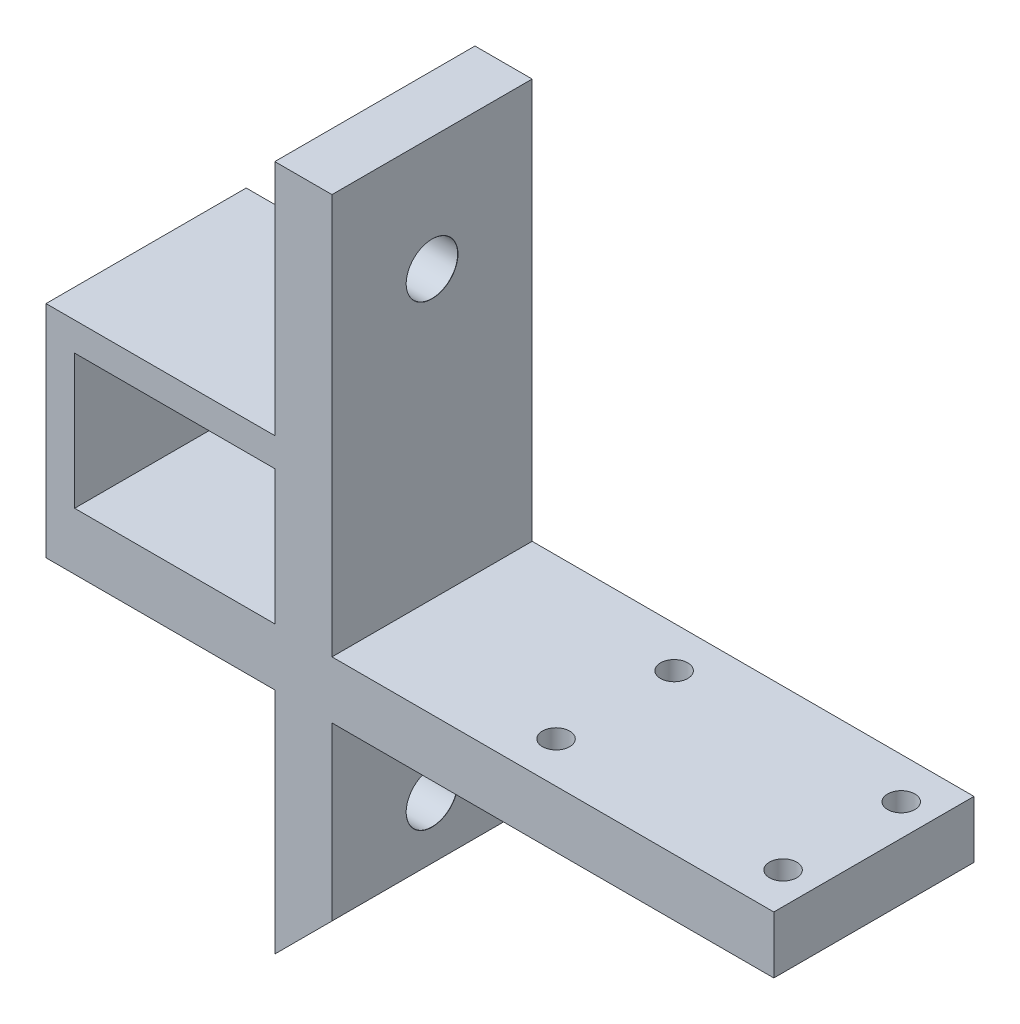
ISO-10303-21;
HEADER;
FILE_DESCRIPTION(('STEP AP214'),'2;1');
FILE_NAME('part.step','',(''),(''),'','','');
FILE_SCHEMA(('AUTOMOTIVE_DESIGN { 1 0 10303 214 1 1 1 1 }'));
ENDSEC;
DATA;
#1=APPLICATION_CONTEXT('core data for automotive mechanical design processes');
#2=APPLICATION_PROTOCOL_DEFINITION('international standard','automotive_design',2000,#1);
#3=PRODUCT_CONTEXT('',#1,'mechanical');
#4=PRODUCT('Part','Part','',(#3));
#5=PRODUCT_RELATED_PRODUCT_CATEGORY('part','',(#4));
#6=PRODUCT_DEFINITION_FORMATION('','',#4);
#7=PRODUCT_DEFINITION_CONTEXT('part definition',#1,'design');
#8=PRODUCT_DEFINITION('design','',#6,#7);
#9=PRODUCT_DEFINITION_SHAPE('','',#8);
#10=(LENGTH_UNIT() NAMED_UNIT(*) SI_UNIT(.MILLI.,.METRE.));
#11=(NAMED_UNIT(*) PLANE_ANGLE_UNIT() SI_UNIT($,.RADIAN.));
#12=(NAMED_UNIT(*) SI_UNIT($,.STERADIAN.) SOLID_ANGLE_UNIT());
#13=UNCERTAINTY_MEASURE_WITH_UNIT(LENGTH_MEASURE(1.E-05),#10,'distance_accuracy_value','');
#14=(GEOMETRIC_REPRESENTATION_CONTEXT(3) GLOBAL_UNCERTAINTY_ASSIGNED_CONTEXT((#13)) GLOBAL_UNIT_ASSIGNED_CONTEXT((#10,
#11,#12)) REPRESENTATION_CONTEXT('',''));
#15=CARTESIAN_POINT('',(0.,0.,0.));
#16=DIRECTION('',(0.,0.,1.));
#17=DIRECTION('',(1.,0.,0.));
#18=AXIS2_PLACEMENT_3D('',#15,#16,#17);
#19=CARTESIAN_POINT('',(-61.85,-40.,17.5));
#20=DIRECTION('',(-1.,0.,0.));
#21=DIRECTION('',(0.,0.,1.));
#22=AXIS2_PLACEMENT_3D('',#19,#20,#21);
#23=PLANE('',#22);
#24=DIRECTION('',(0.,1.,0.));
#25=VECTOR('',#24,1.);
#26=CARTESIAN_POINT('',(-61.85,-40.,17.5));
#27=LINE('',#26,#25);
#28=CARTESIAN_POINT('',(-61.85,10.,17.5));
#29=VERTEX_POINT('',#28);
#30=CARTESIAN_POINT('',(-61.85,33.5,17.5));
#31=VERTEX_POINT('',#30);
#32=EDGE_CURVE('E176',#29,#31,#27,.T.);
#33=ORIENTED_EDGE('',*,*,#32,.T.);
#34=DIRECTION('',(0.,0.,1.));
#35=VECTOR('',#34,1.);
#36=CARTESIAN_POINT('',(-61.85,33.5,-17.5));
#37=LINE('',#36,#35);
#38=CARTESIAN_POINT('',(-61.85,33.5,-17.5));
#39=VERTEX_POINT('',#38);
#40=EDGE_CURVE('E188',#39,#31,#37,.T.);
#41=ORIENTED_EDGE('',*,*,#40,.F.);
#42=DIRECTION('',(0.,1.,0.));
#43=VECTOR('',#42,1.);
#44=CARTESIAN_POINT('',(-61.85,-40.,-17.5));
#45=LINE('',#44,#43);
#46=CARTESIAN_POINT('',(-61.85,10.,-17.5));
#47=VERTEX_POINT('',#46);
#48=EDGE_CURVE('E232',#47,#39,#45,.T.);
#49=ORIENTED_EDGE('',*,*,#48,.F.);
#50=DIRECTION('',(0.,0.,1.));
#51=VECTOR('',#50,1.);
#52=CARTESIAN_POINT('',(-61.85,10.,0.));
#53=LINE('',#52,#51);
#54=EDGE_CURVE('E224',#47,#29,#53,.T.);
#55=ORIENTED_EDGE('',*,*,#54,.T.);
#56=EDGE_LOOP('',(#33,#41,#49,#55));
#57=FACE_BOUND('',#56,.T.);
#58=ADVANCED_FACE('F49',(#57),#23,.T.);
#59=CARTESIAN_POINT('',(-61.85,60.,0.));
#60=DIRECTION('',(-1.,0.,0.));
#61=DIRECTION('',(0.,0.,1.));
#62=AXIS2_PLACEMENT_3D('',#59,#60,#61);
#63=CIRCLE('',#62,4.49999999999999);
#64=CARTESIAN_POINT('',(-61.85,60.,4.49999999999999));
#65=VERTEX_POINT('',#64);
#66=EDGE_CURVE('E54',#65,#65,#63,.T.);
#67=ORIENTED_EDGE('',*,*,#66,.F.);
#68=EDGE_LOOP('',(#67));
#69=FACE_BOUND('',#68,.T.);
#70=CARTESIAN_POINT('',(-61.85,38.5,-17.5));
#71=VERTEX_POINT('',#70);
#72=CARTESIAN_POINT('',(-61.85,80.,-17.5));
#73=VERTEX_POINT('',#72);
#74=EDGE_CURVE('E183',#71,#73,#45,.T.);
#75=ORIENTED_EDGE('',*,*,#74,.F.);
#76=DIRECTION('',(0.,0.,-1.));
#77=VECTOR('',#76,1.);
#78=CARTESIAN_POINT('',(-61.85,38.5,-17.5));
#79=LINE('',#78,#77);
#80=CARTESIAN_POINT('',(-61.85,38.5,17.5));
#81=VERTEX_POINT('',#80);
#82=EDGE_CURVE('E181',#81,#71,#79,.T.);
#83=ORIENTED_EDGE('',*,*,#82,.F.);
#84=CARTESIAN_POINT('',(-61.85,80.,17.5));
#85=VERTEX_POINT('',#84);
#86=EDGE_CURVE('E163',#81,#85,#27,.T.);
#87=ORIENTED_EDGE('',*,*,#86,.T.);
#88=DIRECTION('',(0.,0.,1.));
#89=VECTOR('',#88,1.);
#90=CARTESIAN_POINT('',(-61.85,80.,17.5));
#91=LINE('',#90,#89);
#92=EDGE_CURVE('E212',#73,#85,#91,.T.);
#93=ORIENTED_EDGE('',*,*,#92,.F.);
#94=EDGE_LOOP('',(#75,#83,#87,#93));
#95=FACE_BOUND('',#94,.T.);
#96=ADVANCED_FACE('F182',(#69,#95),#23,.T.);
#97=CARTESIAN_POINT('',(0.,10.,0.));
#98=DIRECTION('',(0.,1.,0.));
#99=DIRECTION('',(0.,0.,1.));
#100=AXIS2_PLACEMENT_3D('',#97,#98,#99);
#101=PLANE('',#100);
#102=DIRECTION('',(0.,0.,-1.));
#103=VECTOR('',#102,1.);
#104=CARTESIAN_POINT('',(-51.85,10.,0.));
#105=LINE('',#104,#103);
#106=CARTESIAN_POINT('',(-51.85,10.,17.5));
#107=VERTEX_POINT('',#106);
#108=CARTESIAN_POINT('',(-51.85,10.,-17.5));
#109=VERTEX_POINT('',#108);
#110=EDGE_CURVE('E239',#107,#109,#105,.T.);
#111=ORIENTED_EDGE('',*,*,#110,.F.);
#112=DIRECTION('',(1.,0.,0.));
#113=VECTOR('',#112,1.);
#114=CARTESIAN_POINT('',(0.,10.,17.5));
#115=LINE('',#114,#113);
#116=CARTESIAN_POINT('',(25.4,10.,17.5));
#117=VERTEX_POINT('',#116);
#118=EDGE_CURVE('E261',#107,#117,#115,.T.);
#119=ORIENTED_EDGE('',*,*,#118,.T.);
#120=DIRECTION('',(0.,0.,-1.));
#121=VECTOR('',#120,1.);
#122=CARTESIAN_POINT('',(25.4,10.,0.));
#123=LINE('',#122,#121);
#124=CARTESIAN_POINT('',(25.4,10.,-17.5));
#125=VERTEX_POINT('',#124);
#126=EDGE_CURVE('E265',#117,#125,#123,.T.);
#127=ORIENTED_EDGE('',*,*,#126,.T.);
#128=DIRECTION('',(1.,0.,0.));
#129=VECTOR('',#128,1.);
#130=CARTESIAN_POINT('',(0.,10.,-17.5));
#131=LINE('',#130,#129);
#132=EDGE_CURVE('E269',#109,#125,#131,.T.);
#133=ORIENTED_EDGE('',*,*,#132,.F.);
#134=EDGE_LOOP('',(#111,#119,#127,#133));
#135=FACE_BOUND('',#134,.T.);
#136=CARTESIAN_POINT('',(19.8502,10.,-10.325));
#137=DIRECTION('',(0.,1.,0.));
#138=DIRECTION('',(0.,0.,1.));
#139=AXIS2_PLACEMENT_3D('',#136,#137,#138);
#140=CIRCLE('',#139,2.38125);
#141=CARTESIAN_POINT('',(19.8502,10.,-7.94375));
#142=VERTEX_POINT('',#141);
#143=EDGE_CURVE('E244',#142,#142,#140,.T.);
#144=ORIENTED_EDGE('',*,*,#143,.F.);
#145=EDGE_LOOP('',(#144));
#146=FACE_BOUND('',#145,.T.);
#147=CARTESIAN_POINT('',(19.8502,10.,10.3252));
#148=DIRECTION('',(0.,1.,0.));
#149=DIRECTION('',(0.,0.,1.));
#150=AXIS2_PLACEMENT_3D('',#147,#148,#149);
#151=CIRCLE('',#150,2.38125);
#152=CARTESIAN_POINT('',(19.8502,10.,12.70645));
#153=VERTEX_POINT('',#152);
#154=EDGE_CURVE('E248',#153,#153,#151,.T.);
#155=ORIENTED_EDGE('',*,*,#154,.F.);
#156=EDGE_LOOP('',(#155));
#157=FACE_BOUND('',#156,.T.);
#158=CARTESIAN_POINT('',(-19.85,10.,10.3252));
#159=DIRECTION('',(0.,1.,0.));
#160=DIRECTION('',(0.,0.,1.));
#161=AXIS2_PLACEMENT_3D('',#158,#159,#160);
#162=CIRCLE('',#161,2.38125);
#163=CARTESIAN_POINT('',(-19.85,10.,12.70645));
#164=VERTEX_POINT('',#163);
#165=EDGE_CURVE('E253',#164,#164,#162,.T.);
#166=ORIENTED_EDGE('',*,*,#165,.F.);
#167=EDGE_LOOP('',(#166));
#168=FACE_BOUND('',#167,.T.);
#169=CARTESIAN_POINT('',(-19.85,10.,-10.325));
#170=DIRECTION('',(0.,1.,0.));
#171=DIRECTION('',(0.,0.,1.));
#172=AXIS2_PLACEMENT_3D('',#169,#170,#171);
#173=CIRCLE('',#172,2.38125);
#174=CARTESIAN_POINT('',(-19.85,10.,-7.94375));
#175=VERTEX_POINT('',#174);
#176=EDGE_CURVE('E257',#175,#175,#173,.T.);
#177=ORIENTED_EDGE('',*,*,#176,.F.);
#178=EDGE_LOOP('',(#177));
#179=FACE_BOUND('',#178,.T.);
#180=ADVANCED_FACE('F394',(#135,#146,#157,#168,#179),#101,.T.);
#181=CARTESIAN_POINT('',(0.,0.,0.));
#182=DIRECTION('',(0.,1.,0.));
#183=DIRECTION('',(0.,0.,1.));
#184=AXIS2_PLACEMENT_3D('',#181,#182,#183);
#185=PLANE('',#184);
#186=CARTESIAN_POINT('',(-19.85,0.,-10.325));
#187=DIRECTION('',(0.,1.,0.));
#188=DIRECTION('',(0.,0.,1.));
#189=AXIS2_PLACEMENT_3D('',#186,#187,#188);
#190=CIRCLE('',#189,2.38125);
#191=CARTESIAN_POINT('',(-19.85,0.,-7.94375));
#192=VERTEX_POINT('',#191);
#193=EDGE_CURVE('E284',#192,#192,#190,.T.);
#194=ORIENTED_EDGE('',*,*,#193,.T.);
#195=EDGE_LOOP('',(#194));
#196=FACE_BOUND('',#195,.T.);
#197=CARTESIAN_POINT('',(-19.85,0.,10.3252));
#198=DIRECTION('',(0.,1.,0.));
#199=DIRECTION('',(0.,0.,1.));
#200=AXIS2_PLACEMENT_3D('',#197,#198,#199);
#201=CIRCLE('',#200,2.38125);
#202=CARTESIAN_POINT('',(-19.85,0.,12.70645));
#203=VERTEX_POINT('',#202);
#204=EDGE_CURVE('E280',#203,#203,#201,.T.);
#205=ORIENTED_EDGE('',*,*,#204,.T.);
#206=EDGE_LOOP('',(#205));
#207=FACE_BOUND('',#206,.T.);
#208=CARTESIAN_POINT('',(19.8502,0.,10.3252));
#209=DIRECTION('',(0.,1.,0.));
#210=DIRECTION('',(0.,0.,1.));
#211=AXIS2_PLACEMENT_3D('',#208,#209,#210);
#212=CIRCLE('',#211,2.38125);
#213=CARTESIAN_POINT('',(19.8502,0.,12.70645));
#214=VERTEX_POINT('',#213);
#215=EDGE_CURVE('E276',#214,#214,#212,.T.);
#216=ORIENTED_EDGE('',*,*,#215,.T.);
#217=EDGE_LOOP('',(#216));
#218=FACE_BOUND('',#217,.T.);
#219=CARTESIAN_POINT('',(19.8502,0.,-10.325));
#220=DIRECTION('',(0.,1.,0.));
#221=DIRECTION('',(0.,0.,1.));
#222=AXIS2_PLACEMENT_3D('',#219,#220,#221);
#223=CIRCLE('',#222,2.38125);
#224=CARTESIAN_POINT('',(19.8502,0.,-7.94375));
#225=VERTEX_POINT('',#224);
#226=EDGE_CURVE('E243',#225,#225,#223,.T.);
#227=ORIENTED_EDGE('',*,*,#226,.T.);
#228=EDGE_LOOP('',(#227));
#229=FACE_BOUND('',#228,.T.);
#230=DIRECTION('',(1.,0.,0.));
#231=VECTOR('',#230,1.);
#232=CARTESIAN_POINT('',(0.,0.,17.5));
#233=LINE('',#232,#231);
#234=CARTESIAN_POINT('',(-51.85,0.,17.5));
#235=VERTEX_POINT('',#234);
#236=CARTESIAN_POINT('',(25.4,0.,17.5));
#237=VERTEX_POINT('',#236);
#238=EDGE_CURVE('E288',#235,#237,#233,.T.);
#239=ORIENTED_EDGE('',*,*,#238,.F.);
#240=DIRECTION('',(0.,0.,-1.));
#241=VECTOR('',#240,1.);
#242=CARTESIAN_POINT('',(-51.85,0.,0.));
#243=LINE('',#242,#241);
#244=CARTESIAN_POINT('',(-51.85,0.,-17.5));
#245=VERTEX_POINT('',#244);
#246=EDGE_CURVE('E319',#235,#245,#243,.T.);
#247=ORIENTED_EDGE('',*,*,#246,.T.);
#248=DIRECTION('',(1.,0.,0.));
#249=VECTOR('',#248,1.);
#250=CARTESIAN_POINT('',(0.,0.,-17.5));
#251=LINE('',#250,#249);
#252=CARTESIAN_POINT('',(25.4,0.,-17.5));
#253=VERTEX_POINT('',#252);
#254=EDGE_CURVE('E297',#245,#253,#251,.T.);
#255=ORIENTED_EDGE('',*,*,#254,.T.);
#256=DIRECTION('',(0.,0.,-1.));
#257=VECTOR('',#256,1.);
#258=CARTESIAN_POINT('',(25.4,0.,0.));
#259=LINE('',#258,#257);
#260=EDGE_CURVE('E293',#237,#253,#259,.T.);
#261=ORIENTED_EDGE('',*,*,#260,.F.);
#262=EDGE_LOOP('',(#239,#247,#255,#261));
#263=FACE_BOUND('',#262,.T.);
#264=ADVANCED_FACE('F403',(#196,#207,#218,#229,#263),#185,.F.);
#265=CARTESIAN_POINT('',(0.,10.,17.5));
#266=DIRECTION('',(0.,0.,-1.));
#267=DIRECTION('',(-1.,0.,0.));
#268=AXIS2_PLACEMENT_3D('',#265,#266,#267);
#269=PLANE('',#268);
#270=CARTESIAN_POINT('',(-96.85,10.,17.5));
#271=VERTEX_POINT('',#270);
#272=EDGE_CURVE('E262',#271,#29,#115,.T.);
#273=ORIENTED_EDGE('',*,*,#272,.F.);
#274=DIRECTION('',(0.,1.,0.));
#275=VECTOR('',#274,1.);
#276=CARTESIAN_POINT('',(-96.85,33.5,17.5));
#277=LINE('',#276,#275);
#278=CARTESIAN_POINT('',(-96.85,33.5,17.5));
#279=VERTEX_POINT('',#278);
#280=EDGE_CURVE('E336',#271,#279,#277,.T.);
#281=ORIENTED_EDGE('',*,*,#280,.T.);
#282=DIRECTION('',(1.,0.,0.));
#283=VECTOR('',#282,1.);
#284=CARTESIAN_POINT('',(-137.205339059327,33.5,17.5));
#285=LINE('',#284,#283);
#286=EDGE_CURVE('E360',#279,#31,#285,.T.);
#287=ORIENTED_EDGE('',*,*,#286,.T.);
#288=ORIENTED_EDGE('',*,*,#32,.F.);
#289=EDGE_LOOP('',(#273,#281,#287,#288));
#290=FACE_BOUND('',#289,.T.);
#291=CARTESIAN_POINT('',(-61.85,-40.,17.5));
#292=VERTEX_POINT('',#291);
#293=CARTESIAN_POINT('',(-61.85,0.,17.5));
#294=VERTEX_POINT('',#293);
#295=EDGE_CURVE('E179',#292,#294,#27,.T.);
#296=ORIENTED_EDGE('',*,*,#295,.F.);
#297=DIRECTION('',(-0.707106781186549,-0.707106781186547,0.));
#298=VECTOR('',#297,1.);
#299=CARTESIAN_POINT('',(-51.85,-30.,17.5));
#300=LINE('',#299,#298);
#301=CARTESIAN_POINT('',(-51.85,-30.,17.5));
#302=VERTEX_POINT('',#301);
#303=EDGE_CURVE('E11',#292,#302,#300,.F.);
#304=ORIENTED_EDGE('',*,*,#303,.T.);
#305=DIRECTION('',(0.,1.,0.));
#306=VECTOR('',#305,1.);
#307=CARTESIAN_POINT('',(-51.85,-40.,17.5));
#308=LINE('',#307,#306);
#309=EDGE_CURVE('E222',#302,#235,#308,.T.);
#310=ORIENTED_EDGE('',*,*,#309,.T.);
#311=ORIENTED_EDGE('',*,*,#238,.T.);
#312=DIRECTION('',(0.,-1.,0.));
#313=VECTOR('',#312,1.);
#314=CARTESIAN_POINT('',(25.4,10.,17.5));
#315=LINE('',#314,#313);
#316=EDGE_CURVE('E312',#117,#237,#315,.T.);
#317=ORIENTED_EDGE('',*,*,#316,.F.);
#318=ORIENTED_EDGE('',*,*,#118,.F.);
#319=CARTESIAN_POINT('',(-51.85,80.,17.5));
#320=VERTEX_POINT('',#319);
#321=EDGE_CURVE('E225',#107,#320,#308,.T.);
#322=ORIENTED_EDGE('',*,*,#321,.T.);
#323=DIRECTION('',(1.,0.,0.));
#324=VECTOR('',#323,1.);
#325=CARTESIAN_POINT('',(-61.85,80.,17.5));
#326=LINE('',#325,#324);
#327=EDGE_CURVE('E171',#85,#320,#326,.T.);
#328=ORIENTED_EDGE('',*,*,#327,.F.);
#329=ORIENTED_EDGE('',*,*,#86,.F.);
#330=DIRECTION('',(1.,0.,0.));
#331=VECTOR('',#330,1.);
#332=CARTESIAN_POINT('',(-137.205339059327,38.5,17.5));
#333=LINE('',#332,#331);
#334=CARTESIAN_POINT('',(-101.85,38.5,17.5));
#335=VERTEX_POINT('',#334);
#336=EDGE_CURVE('E168',#335,#81,#333,.T.);
#337=ORIENTED_EDGE('',*,*,#336,.F.);
#338=DIRECTION('',(0.,-1.,0.));
#339=VECTOR('',#338,1.);
#340=CARTESIAN_POINT('',(-101.85,10.,17.5));
#341=LINE('',#340,#339);
#342=CARTESIAN_POINT('',(-101.85,0.,17.5));
#343=VERTEX_POINT('',#342);
#344=EDGE_CURVE('E272',#335,#343,#341,.T.);
#345=ORIENTED_EDGE('',*,*,#344,.T.);
#346=EDGE_CURVE('E289',#343,#294,#233,.T.);
#347=ORIENTED_EDGE('',*,*,#346,.T.);
#348=EDGE_LOOP('',(#296,#304,#310,#311,#317,#318,#322,#328,#329,#337,#345,#347));
#349=FACE_BOUND('',#348,.T.);
#350=ADVANCED_FACE('F165',(#290,#349),#269,.F.);
#351=CARTESIAN_POINT('',(25.4,10.,0.));
#352=DIRECTION('',(-1.,0.,0.));
#353=DIRECTION('',(0.,0.,1.));
#354=AXIS2_PLACEMENT_3D('',#351,#352,#353);
#355=PLANE('',#354);
#356=ORIENTED_EDGE('',*,*,#260,.T.);
#357=DIRECTION('',(0.,-1.,0.));
#358=VECTOR('',#357,1.);
#359=CARTESIAN_POINT('',(25.4,10.,-17.5));
#360=LINE('',#359,#358);
#361=EDGE_CURVE('E308',#125,#253,#360,.T.);
#362=ORIENTED_EDGE('',*,*,#361,.F.);
#363=ORIENTED_EDGE('',*,*,#126,.F.);
#364=ORIENTED_EDGE('',*,*,#316,.T.);
#365=EDGE_LOOP('',(#356,#362,#363,#364));
#366=FACE_BOUND('',#365,.T.);
#367=ADVANCED_FACE('F399',(#366),#355,.F.);
#368=CARTESIAN_POINT('',(0.,10.,-17.5));
#369=DIRECTION('',(0.,0.,-1.));
#370=DIRECTION('',(-1.,0.,0.));
#371=AXIS2_PLACEMENT_3D('',#368,#369,#370);
#372=PLANE('',#371);
#373=DIRECTION('',(0.,-1.,0.));
#374=VECTOR('',#373,1.);
#375=CARTESIAN_POINT('',(-96.85,10.,-17.5));
#376=LINE('',#375,#374);
#377=CARTESIAN_POINT('',(-96.85,33.5,-17.5));
#378=VERTEX_POINT('',#377);
#379=CARTESIAN_POINT('',(-96.85,10.,-17.5));
#380=VERTEX_POINT('',#379);
#381=EDGE_CURVE('E189',#378,#380,#376,.T.);
#382=ORIENTED_EDGE('',*,*,#381,.T.);
#383=EDGE_CURVE('E73',#380,#47,#131,.T.);
#384=ORIENTED_EDGE('',*,*,#383,.T.);
#385=ORIENTED_EDGE('',*,*,#48,.T.);
#386=DIRECTION('',(1.,0.,0.));
#387=VECTOR('',#386,1.);
#388=CARTESIAN_POINT('',(-137.205339059327,33.5,-17.5));
#389=LINE('',#388,#387);
#390=EDGE_CURVE('E201',#378,#39,#389,.T.);
#391=ORIENTED_EDGE('',*,*,#390,.F.);
#392=EDGE_LOOP('',(#382,#384,#385,#391));
#393=FACE_BOUND('',#392,.T.);
#394=DIRECTION('',(0.,1.,0.));
#395=VECTOR('',#394,1.);
#396=CARTESIAN_POINT('',(-51.85,-40.,-17.5));
#397=LINE('',#396,#395);
#398=CARTESIAN_POINT('',(-51.85,-30.,-17.5));
#399=VERTEX_POINT('',#398);
#400=EDGE_CURVE('E233',#399,#245,#397,.T.);
#401=ORIENTED_EDGE('',*,*,#400,.F.);
#402=DIRECTION('',(0.707106781186549,0.707106781186547,0.));
#403=VECTOR('',#402,1.);
#404=CARTESIAN_POINT('',(-5.92499999999994,15.925,-17.5));
#405=LINE('',#404,#403);
#406=CARTESIAN_POINT('',(-61.85,-40.,-17.5));
#407=VERTEX_POINT('',#406);
#408=EDGE_CURVE('E60',#399,#407,#405,.F.);
#409=ORIENTED_EDGE('',*,*,#408,.T.);
#410=CARTESIAN_POINT('',(-61.85,0.,-17.5));
#411=VERTEX_POINT('',#410);
#412=EDGE_CURVE('E177',#407,#411,#45,.T.);
#413=ORIENTED_EDGE('',*,*,#412,.T.);
#414=CARTESIAN_POINT('',(-101.85,0.,-17.5));
#415=VERTEX_POINT('',#414);
#416=EDGE_CURVE('E298',#415,#411,#251,.T.);
#417=ORIENTED_EDGE('',*,*,#416,.F.);
#418=DIRECTION('',(0.,-1.,0.));
#419=VECTOR('',#418,1.);
#420=CARTESIAN_POINT('',(-101.85,10.,-17.5));
#421=LINE('',#420,#419);
#422=CARTESIAN_POINT('',(-101.85,38.5,-17.5));
#423=VERTEX_POINT('',#422);
#424=EDGE_CURVE('E305',#423,#415,#421,.T.);
#425=ORIENTED_EDGE('',*,*,#424,.F.);
#426=DIRECTION('',(1.,0.,0.));
#427=VECTOR('',#426,1.);
#428=CARTESIAN_POINT('',(-137.205339059327,38.5,-17.5));
#429=LINE('',#428,#427);
#430=EDGE_CURVE('E195',#423,#71,#429,.T.);
#431=ORIENTED_EDGE('',*,*,#430,.T.);
#432=ORIENTED_EDGE('',*,*,#74,.T.);
#433=DIRECTION('',(-1.,0.,0.));
#434=VECTOR('',#433,1.);
#435=CARTESIAN_POINT('',(-61.85,80.,-17.5));
#436=LINE('',#435,#434);
#437=CARTESIAN_POINT('',(-51.85,80.,-17.5));
#438=VERTEX_POINT('',#437);
#439=EDGE_CURVE('E208',#438,#73,#436,.T.);
#440=ORIENTED_EDGE('',*,*,#439,.F.);
#441=EDGE_CURVE('E221',#109,#438,#397,.T.);
#442=ORIENTED_EDGE('',*,*,#441,.F.);
#443=ORIENTED_EDGE('',*,*,#132,.T.);
#444=ORIENTED_EDGE('',*,*,#361,.T.);
#445=ORIENTED_EDGE('',*,*,#254,.F.);
#446=EDGE_LOOP('',(#401,#409,#413,#417,#425,#431,#432,#440,#442,#443,#444,#445));
#447=FACE_BOUND('',#446,.T.);
#448=ADVANCED_FACE('F375',(#393,#447),#372,.T.);
#449=CARTESIAN_POINT('',(-19.85,10.,-10.325));
#450=DIRECTION('',(0.,-1.,0.));
#451=DIRECTION('',(0.,0.,-1.));
#452=AXIS2_PLACEMENT_3D('',#449,#450,#451);
#453=CYLINDRICAL_SURFACE('',#452,2.38125);
#454=ORIENTED_EDGE('',*,*,#176,.T.);
#455=EDGE_LOOP('',(#454));
#456=FACE_BOUND('',#455,.T.);
#457=ORIENTED_EDGE('',*,*,#193,.F.);
#458=EDGE_LOOP('',(#457));
#459=FACE_BOUND('',#458,.T.);
#460=ADVANCED_FACE('F486',(#456,#459),#453,.F.);
#461=CARTESIAN_POINT('',(-19.85,10.,10.3252));
#462=DIRECTION('',(0.,-1.,0.));
#463=DIRECTION('',(0.,0.,-1.));
#464=AXIS2_PLACEMENT_3D('',#461,#462,#463);
#465=CYLINDRICAL_SURFACE('',#464,2.38125);
#466=ORIENTED_EDGE('',*,*,#165,.T.);
#467=EDGE_LOOP('',(#466));
#468=FACE_BOUND('',#467,.T.);
#469=ORIENTED_EDGE('',*,*,#204,.F.);
#470=EDGE_LOOP('',(#469));
#471=FACE_BOUND('',#470,.T.);
#472=ADVANCED_FACE('F480',(#468,#471),#465,.F.);
#473=CARTESIAN_POINT('',(19.8502,10.,10.3252));
#474=DIRECTION('',(0.,-1.,0.));
#475=DIRECTION('',(0.,0.,-1.));
#476=AXIS2_PLACEMENT_3D('',#473,#474,#475);
#477=CYLINDRICAL_SURFACE('',#476,2.38125);
#478=ORIENTED_EDGE('',*,*,#154,.T.);
#479=EDGE_LOOP('',(#478));
#480=FACE_BOUND('',#479,.T.);
#481=ORIENTED_EDGE('',*,*,#215,.F.);
#482=EDGE_LOOP('',(#481));
#483=FACE_BOUND('',#482,.T.);
#484=ADVANCED_FACE('F438',(#480,#483),#477,.F.);
#485=CARTESIAN_POINT('',(19.8502,10.,-10.325));
#486=DIRECTION('',(0.,-1.,0.));
#487=DIRECTION('',(0.,0.,-1.));
#488=AXIS2_PLACEMENT_3D('',#485,#486,#487);
#489=CYLINDRICAL_SURFACE('',#488,2.38125);
#490=ORIENTED_EDGE('',*,*,#143,.T.);
#491=EDGE_LOOP('',(#490));
#492=FACE_BOUND('',#491,.T.);
#493=ORIENTED_EDGE('',*,*,#226,.F.);
#494=EDGE_LOOP('',(#493));
#495=FACE_BOUND('',#494,.T.);
#496=ADVANCED_FACE('F430',(#492,#495),#489,.F.);
#497=CARTESIAN_POINT('',(-101.85,10.,0.));
#498=DIRECTION('',(1.,0.,0.));
#499=DIRECTION('',(0.,0.,-1.));
#500=AXIS2_PLACEMENT_3D('',#497,#498,#499);
#501=PLANE('',#500);
#502=DIRECTION('',(0.,0.,1.));
#503=VECTOR('',#502,1.);
#504=CARTESIAN_POINT('',(-101.85,0.,0.));
#505=LINE('',#504,#503);
#506=EDGE_CURVE('E249',#415,#343,#505,.T.);
#507=ORIENTED_EDGE('',*,*,#506,.T.);
#508=ORIENTED_EDGE('',*,*,#344,.F.);
#509=DIRECTION('',(0.,0.,1.));
#510=VECTOR('',#509,1.);
#511=CARTESIAN_POINT('',(-101.85,38.5,-17.5));
#512=LINE('',#511,#510);
#513=EDGE_CURVE('E193',#423,#335,#512,.T.);
#514=ORIENTED_EDGE('',*,*,#513,.F.);
#515=ORIENTED_EDGE('',*,*,#424,.T.);
#516=EDGE_LOOP('',(#507,#508,#514,#515));
#517=FACE_BOUND('',#516,.T.);
#518=ADVANCED_FACE('F427',(#517),#501,.F.);
#519=DIRECTION('',(0.,0.,1.));
#520=VECTOR('',#519,1.);
#521=CARTESIAN_POINT('',(-96.85,10.,17.5));
#522=LINE('',#521,#520);
#523=EDGE_CURVE('E68',#380,#271,#522,.T.);
#524=ORIENTED_EDGE('',*,*,#523,.T.);
#525=ORIENTED_EDGE('',*,*,#272,.T.);
#526=ORIENTED_EDGE('',*,*,#54,.F.);
#527=ORIENTED_EDGE('',*,*,#383,.F.);
#528=EDGE_LOOP('',(#524,#525,#526,#527));
#529=FACE_BOUND('',#528,.T.);
#530=ADVANCED_FACE('F429',(#529),#101,.T.);
#531=ORIENTED_EDGE('',*,*,#416,.T.);
#532=DIRECTION('',(0.,0.,1.));
#533=VECTOR('',#532,1.);
#534=CARTESIAN_POINT('',(-61.85,0.,0.));
#535=LINE('',#534,#533);
#536=EDGE_CURVE('E316',#411,#294,#535,.T.);
#537=ORIENTED_EDGE('',*,*,#536,.T.);
#538=ORIENTED_EDGE('',*,*,#346,.F.);
#539=ORIENTED_EDGE('',*,*,#506,.F.);
#540=EDGE_LOOP('',(#531,#537,#538,#539));
#541=FACE_BOUND('',#540,.T.);
#542=ADVANCED_FACE('F424',(#541),#185,.F.);
#543=CARTESIAN_POINT('',(-61.85,-20.,0.));
#544=DIRECTION('',(-1.,0.,0.));
#545=DIRECTION('',(0.,0.,1.));
#546=AXIS2_PLACEMENT_3D('',#543,#544,#545);
#547=CIRCLE('',#546,4.49999999999999);
#548=CARTESIAN_POINT('',(-61.85,-20.,4.49999999999999));
#549=VERTEX_POINT('',#548);
#550=EDGE_CURVE('E328',#549,#549,#547,.T.);
#551=ORIENTED_EDGE('',*,*,#550,.F.);
#552=EDGE_LOOP('',(#551));
#553=FACE_BOUND('',#552,.T.);
#554=ORIENTED_EDGE('',*,*,#536,.F.);
#555=ORIENTED_EDGE('',*,*,#412,.F.);
#556=DIRECTION('',(0.,0.,1.));
#557=VECTOR('',#556,1.);
#558=CARTESIAN_POINT('',(-61.85,-40.,17.5));
#559=LINE('',#558,#557);
#560=EDGE_CURVE('E217',#407,#292,#559,.T.);
#561=ORIENTED_EDGE('',*,*,#560,.T.);
#562=ORIENTED_EDGE('',*,*,#295,.T.);
#563=EDGE_LOOP('',(#554,#555,#561,#562));
#564=FACE_BOUND('',#563,.T.);
#565=ADVANCED_FACE('F421',(#553,#564),#23,.T.);
#566=CARTESIAN_POINT('',(-51.85,-40.,17.5));
#567=DIRECTION('',(1.,0.,0.));
#568=DIRECTION('',(0.,0.,-1.));
#569=AXIS2_PLACEMENT_3D('',#566,#567,#568);
#570=PLANE('',#569);
#571=CARTESIAN_POINT('',(-51.85,-20.,0.));
#572=DIRECTION('',(1.,0.,0.));
#573=DIRECTION('',(0.,0.,-1.));
#574=AXIS2_PLACEMENT_3D('',#571,#572,#573);
#575=CIRCLE('',#574,4.525);
#576=CARTESIAN_POINT('',(-51.85,-20.,-4.525));
#577=VERTEX_POINT('',#576);
#578=EDGE_CURVE('E339',#577,#577,#575,.T.);
#579=ORIENTED_EDGE('',*,*,#578,.F.);
#580=EDGE_LOOP('',(#579));
#581=FACE_BOUND('',#580,.T.);
#582=ORIENTED_EDGE('',*,*,#309,.F.);
#583=DIRECTION('',(0.,0.,-1.));
#584=VECTOR('',#583,1.);
#585=CARTESIAN_POINT('',(-51.85,-30.,17.5));
#586=LINE('',#585,#584);
#587=EDGE_CURVE('E323',#302,#399,#586,.T.);
#588=ORIENTED_EDGE('',*,*,#587,.T.);
#589=ORIENTED_EDGE('',*,*,#400,.T.);
#590=ORIENTED_EDGE('',*,*,#246,.F.);
#591=EDGE_LOOP('',(#582,#588,#589,#590));
#592=FACE_BOUND('',#591,.T.);
#593=ADVANCED_FACE('F414',(#581,#592),#570,.T.);
#594=CARTESIAN_POINT('',(-51.85,60.,0.));
#595=DIRECTION('',(1.,0.,0.));
#596=DIRECTION('',(0.,0.,-1.));
#597=AXIS2_PLACEMENT_3D('',#594,#595,#596);
#598=CIRCLE('',#597,4.525);
#599=CARTESIAN_POINT('',(-51.85,60.,-4.525));
#600=VERTEX_POINT('',#599);
#601=EDGE_CURVE('E587',#600,#600,#598,.T.);
#602=ORIENTED_EDGE('',*,*,#601,.F.);
#603=EDGE_LOOP('',(#602));
#604=FACE_BOUND('',#603,.T.);
#605=ORIENTED_EDGE('',*,*,#321,.F.);
#606=ORIENTED_EDGE('',*,*,#110,.T.);
#607=ORIENTED_EDGE('',*,*,#441,.T.);
#608=DIRECTION('',(0.,0.,-1.));
#609=VECTOR('',#608,1.);
#610=CARTESIAN_POINT('',(-51.85,80.,17.5));
#611=LINE('',#610,#609);
#612=EDGE_CURVE('E199',#320,#438,#611,.T.);
#613=ORIENTED_EDGE('',*,*,#612,.F.);
#614=EDGE_LOOP('',(#605,#606,#607,#613));
#615=FACE_BOUND('',#614,.T.);
#616=ADVANCED_FACE('F385',(#604,#615),#570,.T.);
#617=CARTESIAN_POINT('',(0.,80.,0.));
#618=DIRECTION('',(0.,-1.,0.));
#619=DIRECTION('',(0.,0.,-1.));
#620=AXIS2_PLACEMENT_3D('',#617,#618,#619);
#621=PLANE('',#620);
#622=ORIENTED_EDGE('',*,*,#612,.T.);
#623=ORIENTED_EDGE('',*,*,#439,.T.);
#624=ORIENTED_EDGE('',*,*,#92,.T.);
#625=ORIENTED_EDGE('',*,*,#327,.T.);
#626=EDGE_LOOP('',(#622,#623,#624,#625));
#627=FACE_BOUND('',#626,.T.);
#628=ADVANCED_FACE('F382',(#627),#621,.F.);
#629=CARTESIAN_POINT('',(-51.85,-30.,17.5));
#630=DIRECTION('',(-0.707106781186547,0.707106781186549,0.));
#631=DIRECTION('',(0.,0.,-1.));
#632=AXIS2_PLACEMENT_3D('',#629,#630,#631);
#633=PLANE('',#632);
#634=ORIENTED_EDGE('',*,*,#303,.F.);
#635=ORIENTED_EDGE('',*,*,#560,.F.);
#636=ORIENTED_EDGE('',*,*,#408,.F.);
#637=ORIENTED_EDGE('',*,*,#587,.F.);
#638=EDGE_LOOP('',(#634,#635,#636,#637));
#639=FACE_BOUND('',#638,.T.);
#640=ADVANCED_FACE('F52',(#639),#633,.F.);
#641=CARTESIAN_POINT('',(-137.205339059327,33.5,-17.5));
#642=DIRECTION('',(0.,1.,0.));
#643=DIRECTION('',(0.,0.,1.));
#644=AXIS2_PLACEMENT_3D('',#641,#642,#643);
#645=PLANE('',#644);
#646=ORIENTED_EDGE('',*,*,#286,.F.);
#647=DIRECTION('',(0.,0.,-1.));
#648=VECTOR('',#647,1.);
#649=CARTESIAN_POINT('',(-96.85,33.5,-17.5));
#650=LINE('',#649,#648);
#651=EDGE_CURVE('E351',#279,#378,#650,.T.);
#652=ORIENTED_EDGE('',*,*,#651,.T.);
#653=ORIENTED_EDGE('',*,*,#390,.T.);
#654=ORIENTED_EDGE('',*,*,#40,.T.);
#655=EDGE_LOOP('',(#646,#652,#653,#654));
#656=FACE_BOUND('',#655,.T.);
#657=ADVANCED_FACE('F366',(#656),#645,.F.);
#658=CARTESIAN_POINT('',(-137.205339059327,38.5,-17.5));
#659=DIRECTION('',(0.,-1.,0.));
#660=DIRECTION('',(0.,0.,-1.));
#661=AXIS2_PLACEMENT_3D('',#658,#659,#660);
#662=PLANE('',#661);
#663=ORIENTED_EDGE('',*,*,#430,.F.);
#664=ORIENTED_EDGE('',*,*,#513,.T.);
#665=ORIENTED_EDGE('',*,*,#336,.T.);
#666=ORIENTED_EDGE('',*,*,#82,.T.);
#667=EDGE_LOOP('',(#663,#664,#665,#666));
#668=FACE_BOUND('',#667,.T.);
#669=ADVANCED_FACE('F191',(#668),#662,.F.);
#670=CARTESIAN_POINT('',(-96.85,0.,0.));
#671=DIRECTION('',(1.,0.,0.));
#672=DIRECTION('',(0.,0.,-1.));
#673=AXIS2_PLACEMENT_3D('',#670,#671,#672);
#674=PLANE('',#673);
#675=ORIENTED_EDGE('',*,*,#523,.F.);
#676=ORIENTED_EDGE('',*,*,#381,.F.);
#677=ORIENTED_EDGE('',*,*,#651,.F.);
#678=ORIENTED_EDGE('',*,*,#280,.F.);
#679=EDGE_LOOP('',(#675,#676,#677,#678));
#680=FACE_BOUND('',#679,.T.);
#681=ADVANCED_FACE('F507',(#680),#674,.T.);
#682=CARTESIAN_POINT('',(-51.85,-20.,0.));
#683=DIRECTION('',(1.,0.,0.));
#684=DIRECTION('',(0.,0.,-1.));
#685=AXIS2_PLACEMENT_3D('',#682,#683,#684);
#686=CYLINDRICAL_SURFACE('',#685,4.49999999999999);
#687=ORIENTED_EDGE('',*,*,#550,.T.);
#688=EDGE_LOOP('',(#687));
#689=FACE_BOUND('',#688,.T.);
#690=CARTESIAN_POINT('',(-51.875,-20.,0.));
#691=DIRECTION('',(1.,0.,0.));
#692=DIRECTION('',(0.,0.,-1.));
#693=AXIS2_PLACEMENT_3D('',#690,#691,#692);
#694=CIRCLE('',#693,4.49999999999999);
#695=CARTESIAN_POINT('',(-51.875,-20.,-4.49999999999999));
#696=VERTEX_POINT('',#695);
#697=EDGE_CURVE('E331',#696,#696,#694,.T.);
#698=ORIENTED_EDGE('',*,*,#697,.T.);
#699=EDGE_LOOP('',(#698));
#700=FACE_BOUND('',#699,.T.);
#701=ADVANCED_FACE('F534',(#689,#700),#686,.F.);
#702=CARTESIAN_POINT('',(-51.85,-20.,0.));
#703=DIRECTION('',(1.,0.,0.));
#704=DIRECTION('',(0.,0.,-1.));
#705=AXIS2_PLACEMENT_3D('',#702,#703,#704);
#706=CONICAL_SURFACE('',#705,4.525,0.785398163397483);
#707=ORIENTED_EDGE('',*,*,#697,.F.);
#708=EDGE_LOOP('',(#707));
#709=FACE_BOUND('',#708,.T.);
#710=ORIENTED_EDGE('',*,*,#578,.T.);
#711=EDGE_LOOP('',(#710));
#712=FACE_BOUND('',#711,.T.);
#713=ADVANCED_FACE('F544',(#709,#712),#706,.F.);
#714=CARTESIAN_POINT('',(-51.85,60.,0.));
#715=DIRECTION('',(1.,0.,0.));
#716=DIRECTION('',(0.,0.,-1.));
#717=AXIS2_PLACEMENT_3D('',#714,#715,#716);
#718=CYLINDRICAL_SURFACE('',#717,4.49999999999999);
#719=ORIENTED_EDGE('',*,*,#66,.T.);
#720=EDGE_LOOP('',(#719));
#721=FACE_BOUND('',#720,.T.);
#722=CARTESIAN_POINT('',(-51.875,60.,0.));
#723=DIRECTION('',(1.,0.,0.));
#724=DIRECTION('',(0.,0.,-1.));
#725=AXIS2_PLACEMENT_3D('',#722,#723,#724);
#726=CIRCLE('',#725,4.49999999999999);
#727=CARTESIAN_POINT('',(-51.875,60.,-4.49999999999999));
#728=VERTEX_POINT('',#727);
#729=EDGE_CURVE('E589',#728,#728,#726,.T.);
#730=ORIENTED_EDGE('',*,*,#729,.T.);
#731=EDGE_LOOP('',(#730));
#732=FACE_BOUND('',#731,.T.);
#733=ADVANCED_FACE('F554',(#721,#732),#718,.F.);
#734=CARTESIAN_POINT('',(-51.85,60.,0.));
#735=DIRECTION('',(1.,0.,0.));
#736=DIRECTION('',(0.,0.,-1.));
#737=AXIS2_PLACEMENT_3D('',#734,#735,#736);
#738=CONICAL_SURFACE('',#737,4.525,0.785398163397448);
#739=ORIENTED_EDGE('',*,*,#729,.F.);
#740=EDGE_LOOP('',(#739));
#741=FACE_BOUND('',#740,.T.);
#742=ORIENTED_EDGE('',*,*,#601,.T.);
#743=EDGE_LOOP('',(#742));
#744=FACE_BOUND('',#743,.T.);
#745=ADVANCED_FACE('F564',(#741,#744),#738,.F.);
#746=CLOSED_SHELL('',(#58,#96,#180,#264,#350,#367,#448,#460,#472,#484,#496,#518,#530,#542,#565,
#593,#616,#628,#640,#657,#669,#681,#701,#713,#733,#745));
#747=MANIFOLD_SOLID_BREP('B2',#746);
#748=ADVANCED_BREP_SHAPE_REPRESENTATION('',(#18,#747),#14);
#749=SHAPE_DEFINITION_REPRESENTATION(#9,#748);
ENDSEC;
END-ISO-10303-21;
